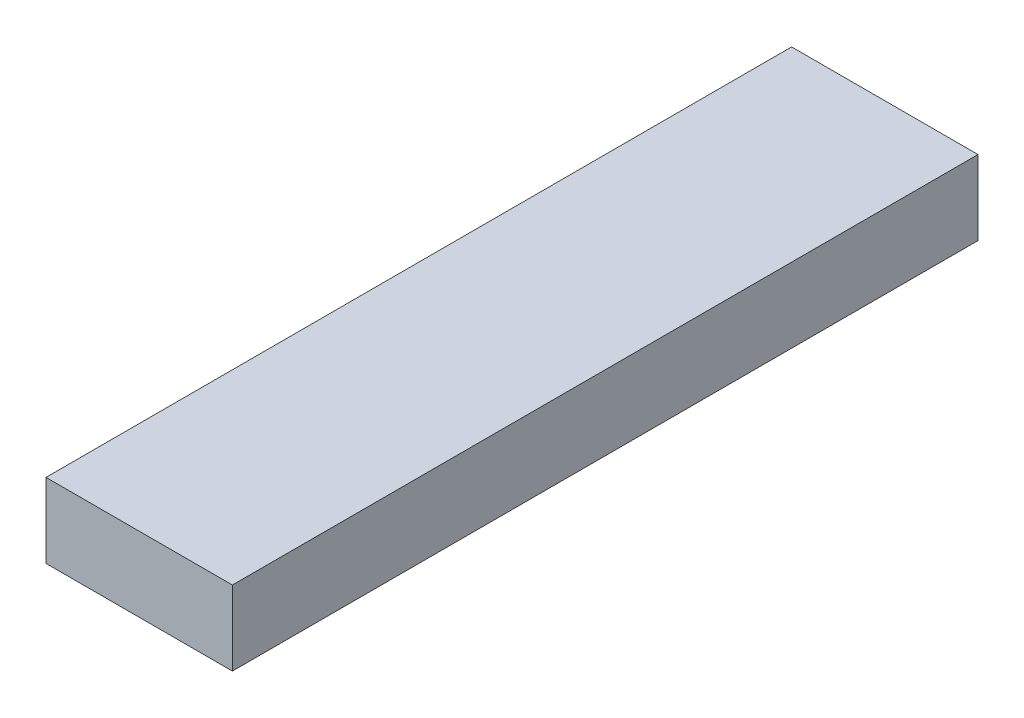
ISO-10303-21;
HEADER;
FILE_DESCRIPTION(('STEP AP214'),'2;1');
FILE_NAME('part.step','',(''),(''),'','','');
FILE_SCHEMA(('AUTOMOTIVE_DESIGN { 1 0 10303 214 1 1 1 1 }'));
ENDSEC;
DATA;
#1=APPLICATION_CONTEXT('core data for automotive mechanical design processes');
#2=APPLICATION_PROTOCOL_DEFINITION('international standard','automotive_design',2000,#1);
#3=PRODUCT_CONTEXT('',#1,'mechanical');
#4=PRODUCT('Part','Part','',(#3));
#5=PRODUCT_RELATED_PRODUCT_CATEGORY('part','',(#4));
#6=PRODUCT_DEFINITION_FORMATION('','',#4);
#7=PRODUCT_DEFINITION_CONTEXT('part definition',#1,'design');
#8=PRODUCT_DEFINITION('design','',#6,#7);
#9=PRODUCT_DEFINITION_SHAPE('','',#8);
#10=(LENGTH_UNIT() NAMED_UNIT(*) SI_UNIT(.MILLI.,.METRE.));
#11=(NAMED_UNIT(*) PLANE_ANGLE_UNIT() SI_UNIT($,.RADIAN.));
#12=(NAMED_UNIT(*) SI_UNIT($,.STERADIAN.) SOLID_ANGLE_UNIT());
#13=UNCERTAINTY_MEASURE_WITH_UNIT(LENGTH_MEASURE(1.E-05),#10,'distance_accuracy_value','');
#14=(GEOMETRIC_REPRESENTATION_CONTEXT(3) GLOBAL_UNCERTAINTY_ASSIGNED_CONTEXT((#13)) GLOBAL_UNIT_ASSIGNED_CONTEXT((#10,
#11,#12)) REPRESENTATION_CONTEXT('',''));
#15=CARTESIAN_POINT('',(0.,0.,0.));
#16=DIRECTION('',(0.,0.,1.));
#17=DIRECTION('',(1.,0.,0.));
#18=AXIS2_PLACEMENT_3D('',#15,#16,#17);
#19=CARTESIAN_POINT('',(50.,20.,0.));
#20=DIRECTION('',(0.,0.,1.));
#21=DIRECTION('',(1.,0.,0.));
#22=AXIS2_PLACEMENT_3D('',#19,#20,#21);
#23=PLANE('',#22);
#24=DIRECTION('',(-1.,0.,0.));
#25=VECTOR('',#24,1.);
#26=CARTESIAN_POINT('',(50.,0.,0.));
#27=LINE('',#26,#25);
#28=CARTESIAN_POINT('',(50.,0.,0.));
#29=VERTEX_POINT('',#28);
#30=CARTESIAN_POINT('',(0.,0.,0.));
#31=VERTEX_POINT('',#30);
#32=EDGE_CURVE('E107',#29,#31,#27,.T.);
#33=ORIENTED_EDGE('',*,*,#32,.T.);
#34=DIRECTION('',(0.,-1.,0.));
#35=VECTOR('',#34,1.);
#36=CARTESIAN_POINT('',(0.,20.,0.));
#37=LINE('',#36,#35);
#38=CARTESIAN_POINT('',(0.,20.,0.));
#39=VERTEX_POINT('',#38);
#40=EDGE_CURVE('E11',#39,#31,#37,.T.);
#41=ORIENTED_EDGE('',*,*,#40,.F.);
#42=DIRECTION('',(-1.,0.,0.));
#43=VECTOR('',#42,1.);
#44=CARTESIAN_POINT('',(50.,20.,0.));
#45=LINE('',#44,#43);
#46=CARTESIAN_POINT('',(50.,20.,0.));
#47=VERTEX_POINT('',#46);
#48=EDGE_CURVE('E91',#47,#39,#45,.T.);
#49=ORIENTED_EDGE('',*,*,#48,.F.);
#50=DIRECTION('',(0.,-1.,0.));
#51=VECTOR('',#50,1.);
#52=CARTESIAN_POINT('',(50.,20.,0.));
#53=LINE('',#52,#51);
#54=EDGE_CURVE('E103',#47,#29,#53,.T.);
#55=ORIENTED_EDGE('',*,*,#54,.T.);
#56=EDGE_LOOP('',(#33,#41,#49,#55));
#57=FACE_BOUND('',#56,.T.);
#58=ADVANCED_FACE('F39',(#57),#23,.F.);
#59=CARTESIAN_POINT('',(0.,20.,0.));
#60=DIRECTION('',(1.,0.,0.));
#61=DIRECTION('',(0.,0.,-1.));
#62=AXIS2_PLACEMENT_3D('',#59,#60,#61);
#63=PLANE('',#62);
#64=DIRECTION('',(0.,0.,1.));
#65=VECTOR('',#64,1.);
#66=CARTESIAN_POINT('',(0.,0.,0.));
#67=LINE('',#66,#65);
#68=CARTESIAN_POINT('',(0.,0.,200.));
#69=VERTEX_POINT('',#68);
#70=EDGE_CURVE('E96',#31,#69,#67,.T.);
#71=ORIENTED_EDGE('',*,*,#70,.T.);
#72=DIRECTION('',(0.,-1.,0.));
#73=VECTOR('',#72,1.);
#74=CARTESIAN_POINT('',(0.,20.,200.));
#75=LINE('',#74,#73);
#76=CARTESIAN_POINT('',(0.,20.,200.));
#77=VERTEX_POINT('',#76);
#78=EDGE_CURVE('E48',#77,#69,#75,.T.);
#79=ORIENTED_EDGE('',*,*,#78,.F.);
#80=DIRECTION('',(0.,0.,1.));
#81=VECTOR('',#80,1.);
#82=CARTESIAN_POINT('',(0.,20.,0.));
#83=LINE('',#82,#81);
#84=EDGE_CURVE('E86',#39,#77,#83,.T.);
#85=ORIENTED_EDGE('',*,*,#84,.F.);
#86=ORIENTED_EDGE('',*,*,#40,.T.);
#87=EDGE_LOOP('',(#71,#79,#85,#86));
#88=FACE_BOUND('',#87,.T.);
#89=ADVANCED_FACE('F95',(#88),#63,.F.);
#90=CARTESIAN_POINT('',(0.,20.,200.));
#91=DIRECTION('',(0.,0.,-1.));
#92=DIRECTION('',(-1.,0.,0.));
#93=AXIS2_PLACEMENT_3D('',#90,#91,#92);
#94=PLANE('',#93);
#95=DIRECTION('',(1.,0.,0.));
#96=VECTOR('',#95,1.);
#97=CARTESIAN_POINT('',(0.,0.,200.));
#98=LINE('',#97,#96);
#99=CARTESIAN_POINT('',(50.,0.,200.));
#100=VERTEX_POINT('',#99);
#101=EDGE_CURVE('E73',#69,#100,#98,.T.);
#102=ORIENTED_EDGE('',*,*,#101,.T.);
#103=DIRECTION('',(0.,-1.,0.));
#104=VECTOR('',#103,1.);
#105=CARTESIAN_POINT('',(50.,20.,200.));
#106=LINE('',#105,#104);
#107=CARTESIAN_POINT('',(50.,20.,200.));
#108=VERTEX_POINT('',#107);
#109=EDGE_CURVE('E98',#108,#100,#106,.T.);
#110=ORIENTED_EDGE('',*,*,#109,.F.);
#111=DIRECTION('',(1.,0.,0.));
#112=VECTOR('',#111,1.);
#113=CARTESIAN_POINT('',(0.,20.,200.));
#114=LINE('',#113,#112);
#115=EDGE_CURVE('E89',#77,#108,#114,.T.);
#116=ORIENTED_EDGE('',*,*,#115,.F.);
#117=ORIENTED_EDGE('',*,*,#78,.T.);
#118=EDGE_LOOP('',(#102,#110,#116,#117));
#119=FACE_BOUND('',#118,.T.);
#120=ADVANCED_FACE('F99',(#119),#94,.F.);
#121=CARTESIAN_POINT('',(50.,20.,200.));
#122=DIRECTION('',(-1.,0.,0.));
#123=DIRECTION('',(0.,0.,1.));
#124=AXIS2_PLACEMENT_3D('',#121,#122,#123);
#125=PLANE('',#124);
#126=DIRECTION('',(0.,0.,-1.));
#127=VECTOR('',#126,1.);
#128=CARTESIAN_POINT('',(50.,0.,200.));
#129=LINE('',#128,#127);
#130=EDGE_CURVE('E79',#100,#29,#129,.T.);
#131=ORIENTED_EDGE('',*,*,#130,.T.);
#132=ORIENTED_EDGE('',*,*,#54,.F.);
#133=DIRECTION('',(0.,0.,-1.));
#134=VECTOR('',#133,1.);
#135=CARTESIAN_POINT('',(50.,20.,200.));
#136=LINE('',#135,#134);
#137=EDGE_CURVE('E56',#108,#47,#136,.T.);
#138=ORIENTED_EDGE('',*,*,#137,.F.);
#139=ORIENTED_EDGE('',*,*,#109,.T.);
#140=EDGE_LOOP('',(#131,#132,#138,#139));
#141=FACE_BOUND('',#140,.T.);
#142=ADVANCED_FACE('F120',(#141),#125,.F.);
#143=CARTESIAN_POINT('',(0.,20.,0.));
#144=DIRECTION('',(0.,1.,0.));
#145=DIRECTION('',(0.,0.,1.));
#146=AXIS2_PLACEMENT_3D('',#143,#144,#145);
#147=PLANE('',#146);
#148=ORIENTED_EDGE('',*,*,#48,.T.);
#149=ORIENTED_EDGE('',*,*,#84,.T.);
#150=ORIENTED_EDGE('',*,*,#115,.T.);
#151=ORIENTED_EDGE('',*,*,#137,.T.);
#152=EDGE_LOOP('',(#148,#149,#150,#151));
#153=FACE_BOUND('',#152,.T.);
#154=ADVANCED_FACE('F87',(#153),#147,.T.);
#155=CARTESIAN_POINT('',(0.,0.,0.));
#156=DIRECTION('',(0.,1.,0.));
#157=DIRECTION('',(0.,0.,1.));
#158=AXIS2_PLACEMENT_3D('',#155,#156,#157);
#159=PLANE('',#158);
#160=ORIENTED_EDGE('',*,*,#32,.F.);
#161=ORIENTED_EDGE('',*,*,#130,.F.);
#162=ORIENTED_EDGE('',*,*,#101,.F.);
#163=ORIENTED_EDGE('',*,*,#70,.F.);
#164=EDGE_LOOP('',(#160,#161,#162,#163));
#165=FACE_BOUND('',#164,.T.);
#166=ADVANCED_FACE('F123',(#165),#159,.F.);
#167=CLOSED_SHELL('',(#58,#89,#120,#142,#154,#166));
#168=MANIFOLD_SOLID_BREP('B2',#167);
#169=ADVANCED_BREP_SHAPE_REPRESENTATION('',(#18,#168),#14);
#170=SHAPE_DEFINITION_REPRESENTATION(#9,#169);
ENDSEC;
END-ISO-10303-21;
